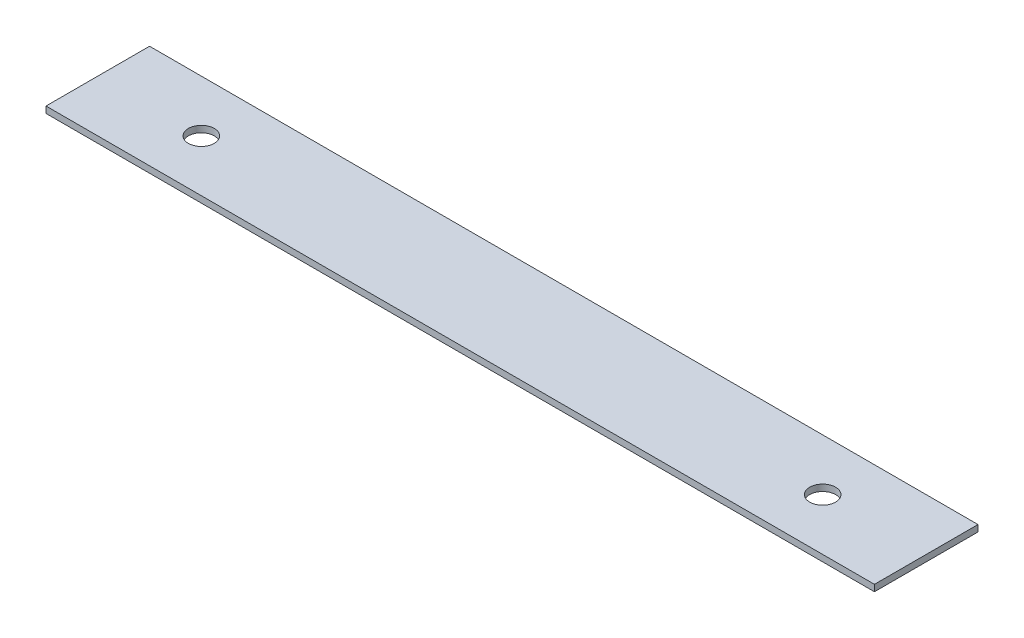
ISO-10303-21;
HEADER;
FILE_DESCRIPTION(('STEP AP214'),'2;1');
FILE_NAME('part.step','',(''),(''),'','','');
FILE_SCHEMA(('AUTOMOTIVE_DESIGN { 1 0 10303 214 1 1 1 1 }'));
ENDSEC;
DATA;
#1=APPLICATION_CONTEXT('core data for automotive mechanical design processes');
#2=APPLICATION_PROTOCOL_DEFINITION('international standard','automotive_design',2000,#1);
#3=PRODUCT_CONTEXT('',#1,'mechanical');
#4=PRODUCT('Part','Part','',(#3));
#5=PRODUCT_RELATED_PRODUCT_CATEGORY('part','',(#4));
#6=PRODUCT_DEFINITION_FORMATION('','',#4);
#7=PRODUCT_DEFINITION_CONTEXT('part definition',#1,'design');
#8=PRODUCT_DEFINITION('design','',#6,#7);
#9=PRODUCT_DEFINITION_SHAPE('','',#8);
#10=(LENGTH_UNIT() NAMED_UNIT(*) SI_UNIT(.MILLI.,.METRE.));
#11=(NAMED_UNIT(*) PLANE_ANGLE_UNIT() SI_UNIT($,.RADIAN.));
#12=(NAMED_UNIT(*) SI_UNIT($,.STERADIAN.) SOLID_ANGLE_UNIT());
#13=UNCERTAINTY_MEASURE_WITH_UNIT(LENGTH_MEASURE(1.E-05),#10,'distance_accuracy_value','');
#14=(GEOMETRIC_REPRESENTATION_CONTEXT(3) GLOBAL_UNCERTAINTY_ASSIGNED_CONTEXT((#13)) GLOBAL_UNIT_ASSIGNED_CONTEXT((#10,
#11,#12)) REPRESENTATION_CONTEXT('',''));
#15=CARTESIAN_POINT('',(0.,0.,0.));
#16=DIRECTION('',(0.,0.,1.));
#17=DIRECTION('',(1.,0.,0.));
#18=AXIS2_PLACEMENT_3D('',#15,#16,#17);
#19=CARTESIAN_POINT('',(-203.2,3.175,0.));
#20=DIRECTION('',(-1.,0.,0.));
#21=DIRECTION('',(0.,0.,1.));
#22=AXIS2_PLACEMENT_3D('',#19,#20,#21);
#23=PLANE('',#22);
#24=DIRECTION('',(0.,0.,-1.));
#25=VECTOR('',#24,1.);
#26=CARTESIAN_POINT('',(-203.2,0.,0.));
#27=LINE('',#26,#25);
#28=CARTESIAN_POINT('',(-203.2,0.,25.4000000000001));
#29=VERTEX_POINT('',#28);
#30=CARTESIAN_POINT('',(-203.2,0.,-25.3999999999999));
#31=VERTEX_POINT('',#30);
#32=EDGE_CURVE('E109',#29,#31,#27,.T.);
#33=ORIENTED_EDGE('',*,*,#32,.F.);
#34=DIRECTION('',(0.,-1.,0.));
#35=VECTOR('',#34,1.);
#36=CARTESIAN_POINT('',(-203.2,3.175,25.4000000000001));
#37=LINE('',#36,#35);
#38=CARTESIAN_POINT('',(-203.2,3.175,25.4000000000001));
#39=VERTEX_POINT('',#38);
#40=EDGE_CURVE('E11',#39,#29,#37,.T.);
#41=ORIENTED_EDGE('',*,*,#40,.F.);
#42=DIRECTION('',(0.,0.,-1.));
#43=VECTOR('',#42,1.);
#44=CARTESIAN_POINT('',(-203.2,3.175,0.));
#45=LINE('',#44,#43);
#46=CARTESIAN_POINT('',(-203.2,3.175,-25.3999999999999));
#47=VERTEX_POINT('',#46);
#48=EDGE_CURVE('E96',#39,#47,#45,.T.);
#49=ORIENTED_EDGE('',*,*,#48,.T.);
#50=DIRECTION('',(0.,-1.,0.));
#51=VECTOR('',#50,1.);
#52=CARTESIAN_POINT('',(-203.2,3.175,-25.3999999999999));
#53=LINE('',#52,#51);
#54=EDGE_CURVE('E75',#47,#31,#53,.T.);
#55=ORIENTED_EDGE('',*,*,#54,.T.);
#56=EDGE_LOOP('',(#33,#41,#49,#55));
#57=FACE_BOUND('',#56,.T.);
#58=ADVANCED_FACE('F35',(#57),#23,.T.);
#59=CARTESIAN_POINT('',(0.,3.175,25.4));
#60=DIRECTION('',(0.,0.,1.));
#61=DIRECTION('',(1.,0.,0.));
#62=AXIS2_PLACEMENT_3D('',#59,#60,#61);
#63=PLANE('',#62);
#64=DIRECTION('',(-1.,0.,0.));
#65=VECTOR('',#64,1.);
#66=CARTESIAN_POINT('',(0.,0.,25.4));
#67=LINE('',#66,#65);
#68=CARTESIAN_POINT('',(203.2,0.,25.4));
#69=VERTEX_POINT('',#68);
#70=EDGE_CURVE('E87',#69,#29,#67,.T.);
#71=ORIENTED_EDGE('',*,*,#70,.F.);
#72=DIRECTION('',(0.,-1.,0.));
#73=VECTOR('',#72,1.);
#74=CARTESIAN_POINT('',(203.2,3.175,25.4));
#75=LINE('',#74,#73);
#76=CARTESIAN_POINT('',(203.2,3.175,25.4));
#77=VERTEX_POINT('',#76);
#78=EDGE_CURVE('E44',#77,#69,#75,.T.);
#79=ORIENTED_EDGE('',*,*,#78,.F.);
#80=DIRECTION('',(-1.,0.,0.));
#81=VECTOR('',#80,1.);
#82=CARTESIAN_POINT('',(0.,3.175,25.4));
#83=LINE('',#82,#81);
#84=EDGE_CURVE('E85',#77,#39,#83,.T.);
#85=ORIENTED_EDGE('',*,*,#84,.T.);
#86=ORIENTED_EDGE('',*,*,#40,.T.);
#87=EDGE_LOOP('',(#71,#79,#85,#86));
#88=FACE_BOUND('',#87,.T.);
#89=ADVANCED_FACE('F83',(#88),#63,.T.);
#90=CARTESIAN_POINT('',(203.2,3.175,0.));
#91=DIRECTION('',(-1.,0.,0.));
#92=DIRECTION('',(0.,0.,1.));
#93=AXIS2_PLACEMENT_3D('',#90,#91,#92);
#94=PLANE('',#93);
#95=DIRECTION('',(0.,0.,-1.));
#96=VECTOR('',#95,1.);
#97=CARTESIAN_POINT('',(203.2,0.,0.));
#98=LINE('',#97,#96);
#99=CARTESIAN_POINT('',(203.2,0.,-25.4));
#100=VERTEX_POINT('',#99);
#101=EDGE_CURVE('E112',#69,#100,#98,.T.);
#102=ORIENTED_EDGE('',*,*,#101,.T.);
#103=DIRECTION('',(0.,-1.,0.));
#104=VECTOR('',#103,1.);
#105=CARTESIAN_POINT('',(203.2,3.175,-25.4));
#106=LINE('',#105,#104);
#107=CARTESIAN_POINT('',(203.2,3.175,-25.4));
#108=VERTEX_POINT('',#107);
#109=EDGE_CURVE('E90',#108,#100,#106,.T.);
#110=ORIENTED_EDGE('',*,*,#109,.F.);
#111=DIRECTION('',(0.,0.,-1.));
#112=VECTOR('',#111,1.);
#113=CARTESIAN_POINT('',(203.2,3.175,0.));
#114=LINE('',#113,#112);
#115=EDGE_CURVE('E92',#77,#108,#114,.T.);
#116=ORIENTED_EDGE('',*,*,#115,.F.);
#117=ORIENTED_EDGE('',*,*,#78,.T.);
#118=EDGE_LOOP('',(#102,#110,#116,#117));
#119=FACE_BOUND('',#118,.T.);
#120=ADVANCED_FACE('F93',(#119),#94,.F.);
#121=CARTESIAN_POINT('',(-152.4,3.175,0.));
#122=DIRECTION('',(0.,-1.,0.));
#123=DIRECTION('',(0.,0.,-1.));
#124=AXIS2_PLACEMENT_3D('',#121,#122,#123);
#125=CYLINDRICAL_SURFACE('',#124,6.35);
#126=CARTESIAN_POINT('',(-152.4,3.175,0.));
#127=DIRECTION('',(0.,1.,0.));
#128=DIRECTION('',(0.,0.,1.));
#129=AXIS2_PLACEMENT_3D('',#126,#127,#128);
#130=CIRCLE('',#129,6.35);
#131=CARTESIAN_POINT('',(-152.4,3.175,6.35));
#132=VERTEX_POINT('',#131);
#133=EDGE_CURVE('E98',#132,#132,#130,.T.);
#134=ORIENTED_EDGE('',*,*,#133,.T.);
#135=EDGE_LOOP('',(#134));
#136=FACE_BOUND('',#135,.T.);
#137=CARTESIAN_POINT('',(-152.4,0.,0.));
#138=DIRECTION('',(0.,1.,0.));
#139=DIRECTION('',(0.,0.,1.));
#140=AXIS2_PLACEMENT_3D('',#137,#138,#139);
#141=CIRCLE('',#140,6.35);
#142=CARTESIAN_POINT('',(-152.4,0.,6.35));
#143=VERTEX_POINT('',#142);
#144=EDGE_CURVE('E106',#143,#143,#141,.T.);
#145=ORIENTED_EDGE('',*,*,#144,.F.);
#146=EDGE_LOOP('',(#145));
#147=FACE_BOUND('',#146,.T.);
#148=ADVANCED_FACE('F127',(#136,#147),#125,.F.);
#149=CARTESIAN_POINT('',(152.4,3.175,0.));
#150=DIRECTION('',(0.,-1.,0.));
#151=DIRECTION('',(0.,0.,-1.));
#152=AXIS2_PLACEMENT_3D('',#149,#150,#151);
#153=CYLINDRICAL_SURFACE('',#152,6.35);
#154=CARTESIAN_POINT('',(152.4,3.175,0.));
#155=DIRECTION('',(0.,1.,0.));
#156=DIRECTION('',(0.,0.,1.));
#157=AXIS2_PLACEMENT_3D('',#154,#155,#156);
#158=CIRCLE('',#157,6.35);
#159=CARTESIAN_POINT('',(152.4,3.175,6.35));
#160=VERTEX_POINT('',#159);
#161=EDGE_CURVE('E115',#160,#160,#158,.T.);
#162=ORIENTED_EDGE('',*,*,#161,.T.);
#163=EDGE_LOOP('',(#162));
#164=FACE_BOUND('',#163,.T.);
#165=CARTESIAN_POINT('',(152.4,0.,0.));
#166=DIRECTION('',(0.,1.,0.));
#167=DIRECTION('',(0.,0.,1.));
#168=AXIS2_PLACEMENT_3D('',#165,#166,#167);
#169=CIRCLE('',#168,6.35);
#170=CARTESIAN_POINT('',(152.4,0.,6.35));
#171=VERTEX_POINT('',#170);
#172=EDGE_CURVE('E103',#171,#171,#169,.T.);
#173=ORIENTED_EDGE('',*,*,#172,.F.);
#174=EDGE_LOOP('',(#173));
#175=FACE_BOUND('',#174,.T.);
#176=ADVANCED_FACE('F37',(#164,#175),#153,.F.);
#177=CARTESIAN_POINT('',(0.,3.175,-25.4));
#178=DIRECTION('',(0.,0.,1.));
#179=DIRECTION('',(1.,0.,0.));
#180=AXIS2_PLACEMENT_3D('',#177,#178,#179);
#181=PLANE('',#180);
#182=DIRECTION('',(-1.,0.,0.));
#183=VECTOR('',#182,1.);
#184=CARTESIAN_POINT('',(0.,0.,-25.4));
#185=LINE('',#184,#183);
#186=EDGE_CURVE('E68',#100,#31,#185,.T.);
#187=ORIENTED_EDGE('',*,*,#186,.T.);
#188=ORIENTED_EDGE('',*,*,#54,.F.);
#189=DIRECTION('',(-1.,0.,0.));
#190=VECTOR('',#189,1.);
#191=CARTESIAN_POINT('',(0.,3.175,-25.4));
#192=LINE('',#191,#190);
#193=EDGE_CURVE('E52',#108,#47,#192,.T.);
#194=ORIENTED_EDGE('',*,*,#193,.F.);
#195=ORIENTED_EDGE('',*,*,#109,.T.);
#196=EDGE_LOOP('',(#187,#188,#194,#195));
#197=FACE_BOUND('',#196,.T.);
#198=ADVANCED_FACE('F118',(#197),#181,.F.);
#199=CARTESIAN_POINT('',(0.,3.175,0.));
#200=DIRECTION('',(0.,1.,0.));
#201=DIRECTION('',(0.,0.,1.));
#202=AXIS2_PLACEMENT_3D('',#199,#200,#201);
#203=PLANE('',#202);
#204=ORIENTED_EDGE('',*,*,#161,.F.);
#205=EDGE_LOOP('',(#204));
#206=FACE_BOUND('',#205,.T.);
#207=ORIENTED_EDGE('',*,*,#133,.F.);
#208=EDGE_LOOP('',(#207));
#209=FACE_BOUND('',#208,.T.);
#210=ORIENTED_EDGE('',*,*,#48,.F.);
#211=ORIENTED_EDGE('',*,*,#84,.F.);
#212=ORIENTED_EDGE('',*,*,#115,.T.);
#213=ORIENTED_EDGE('',*,*,#193,.T.);
#214=EDGE_LOOP('',(#210,#211,#212,#213));
#215=FACE_BOUND('',#214,.T.);
#216=ADVANCED_FACE('F95',(#206,#209,#215),#203,.T.);
#217=CARTESIAN_POINT('',(0.,0.,0.));
#218=DIRECTION('',(0.,1.,0.));
#219=DIRECTION('',(0.,0.,1.));
#220=AXIS2_PLACEMENT_3D('',#217,#218,#219);
#221=PLANE('',#220);
#222=ORIENTED_EDGE('',*,*,#172,.T.);
#223=EDGE_LOOP('',(#222));
#224=FACE_BOUND('',#223,.T.);
#225=ORIENTED_EDGE('',*,*,#144,.T.);
#226=EDGE_LOOP('',(#225));
#227=FACE_BOUND('',#226,.T.);
#228=ORIENTED_EDGE('',*,*,#32,.T.);
#229=ORIENTED_EDGE('',*,*,#186,.F.);
#230=ORIENTED_EDGE('',*,*,#101,.F.);
#231=ORIENTED_EDGE('',*,*,#70,.T.);
#232=EDGE_LOOP('',(#228,#229,#230,#231));
#233=FACE_BOUND('',#232,.T.);
#234=ADVANCED_FACE('F119',(#224,#227,#233),#221,.F.);
#235=CLOSED_SHELL('',(#58,#89,#120,#148,#176,#198,#216,#234));
#236=MANIFOLD_SOLID_BREP('B2',#235);
#237=ADVANCED_BREP_SHAPE_REPRESENTATION('',(#18,#236),#14);
#238=SHAPE_DEFINITION_REPRESENTATION(#9,#237);
ENDSEC;
END-ISO-10303-21;
